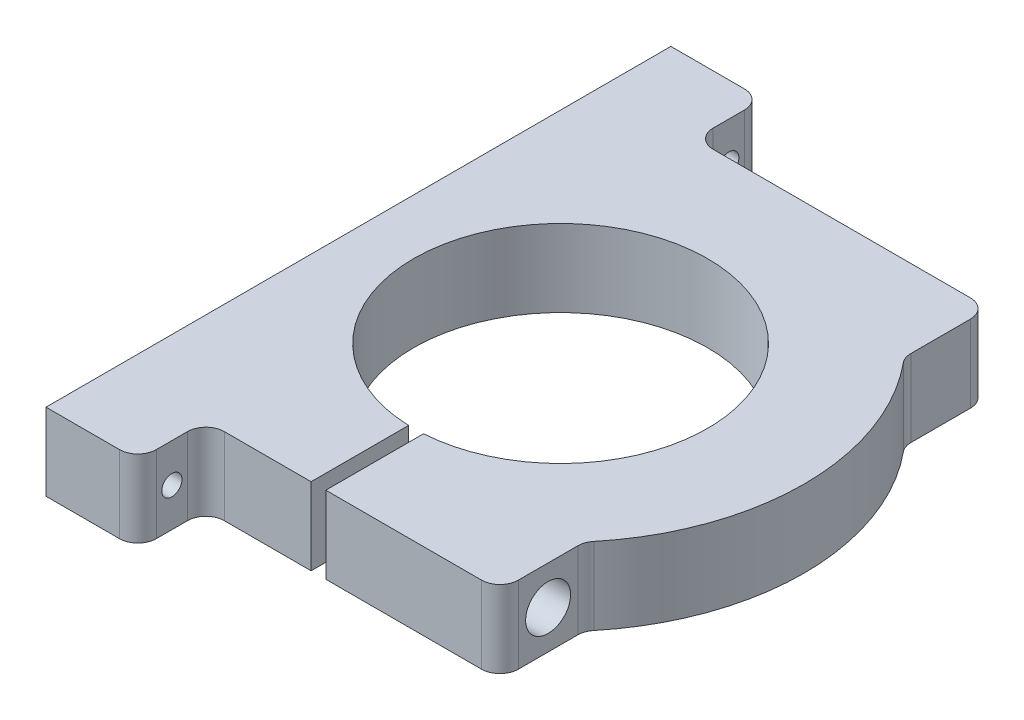
ISO-10303-21;
HEADER;
FILE_DESCRIPTION(('STEP AP214'),'2;1');
FILE_NAME('part.step','',(''),(''),'','','');
FILE_SCHEMA(('AUTOMOTIVE_DESIGN { 1 0 10303 214 1 1 1 1 }'));
ENDSEC;
DATA;
#1=APPLICATION_CONTEXT('core data for automotive mechanical design processes');
#2=APPLICATION_PROTOCOL_DEFINITION('international standard','automotive_design',2000,#1);
#3=PRODUCT_CONTEXT('',#1,'mechanical');
#4=PRODUCT('Part','Part','',(#3));
#5=PRODUCT_RELATED_PRODUCT_CATEGORY('part','',(#4));
#6=PRODUCT_DEFINITION_FORMATION('','',#4);
#7=PRODUCT_DEFINITION_CONTEXT('part definition',#1,'design');
#8=PRODUCT_DEFINITION('design','',#6,#7);
#9=PRODUCT_DEFINITION_SHAPE('','',#8);
#10=(LENGTH_UNIT() NAMED_UNIT(*) SI_UNIT(.MILLI.,.METRE.));
#11=(NAMED_UNIT(*) PLANE_ANGLE_UNIT() SI_UNIT($,.RADIAN.));
#12=(NAMED_UNIT(*) SI_UNIT($,.STERADIAN.) SOLID_ANGLE_UNIT());
#13=UNCERTAINTY_MEASURE_WITH_UNIT(LENGTH_MEASURE(1.E-05),#10,'distance_accuracy_value','');
#14=(GEOMETRIC_REPRESENTATION_CONTEXT(3) GLOBAL_UNCERTAINTY_ASSIGNED_CONTEXT((#13)) GLOBAL_UNIT_ASSIGNED_CONTEXT((#10,
#11,#12)) REPRESENTATION_CONTEXT('',''));
#15=CARTESIAN_POINT('',(0.,0.,0.));
#16=DIRECTION('',(0.,0.,1.));
#17=DIRECTION('',(1.,0.,0.));
#18=AXIS2_PLACEMENT_3D('',#15,#16,#17);
#19=CARTESIAN_POINT('',(-34.049591976291,-21.,0.));
#20=DIRECTION('',(-1.,0.,0.));
#21=DIRECTION('',(0.,0.,1.));
#22=AXIS2_PLACEMENT_3D('',#19,#20,#21);
#23=PLANE('',#22);
#24=CARTESIAN_POINT('',(-34.049591976291,-10.5,-263.540774929207));
#25=DIRECTION('',(1.,0.,0.));
#26=DIRECTION('',(0.,0.,-1.));
#27=AXIS2_PLACEMENT_3D('',#24,#25,#26);
#28=CIRCLE('',#27,2.1);
#29=CARTESIAN_POINT('',(-34.049591976291,-10.5,-265.640774929207));
#30=VERTEX_POINT('',#29);
#31=EDGE_CURVE('E509',#30,#30,#28,.T.);
#32=ORIENTED_EDGE('',*,*,#31,.F.);
#33=EDGE_LOOP('',(#32));
#34=FACE_BOUND('',#33,.T.);
#35=DIRECTION('',(0.,0.,1.));
#36=VECTOR('',#35,1.);
#37=CARTESIAN_POINT('',(-34.049591976291,0.,0.));
#38=LINE('',#37,#36);
#39=CARTESIAN_POINT('',(-34.049591976291,0.,-276.961503392199));
#40=VERTEX_POINT('',#39);
#41=CARTESIAN_POINT('',(-34.049591976291,0.,-250.437863594199));
#42=VERTEX_POINT('',#41);
#43=EDGE_CURVE('E240',#40,#42,#38,.T.);
#44=ORIENTED_EDGE('',*,*,#43,.T.);
#45=DIRECTION('',(0.,1.,0.));
#46=VECTOR('',#45,1.);
#47=CARTESIAN_POINT('',(-34.049591976291,-21.,-250.437863594199));
#48=LINE('',#47,#46);
#49=CARTESIAN_POINT('',(-34.049591976291,-21.,-250.437863594199));
#50=VERTEX_POINT('',#49);
#51=EDGE_CURVE('E201',#50,#42,#48,.T.);
#52=ORIENTED_EDGE('',*,*,#51,.F.);
#53=DIRECTION('',(0.,0.,1.));
#54=VECTOR('',#53,1.);
#55=CARTESIAN_POINT('',(-34.049591976291,-21.,0.));
#56=LINE('',#55,#54);
#57=CARTESIAN_POINT('',(-34.049591976291,-21.,-276.961503392199));
#58=VERTEX_POINT('',#57);
#59=EDGE_CURVE('E199',#58,#50,#56,.T.);
#60=ORIENTED_EDGE('',*,*,#59,.F.);
#61=DIRECTION('',(0.,1.,0.));
#62=VECTOR('',#61,1.);
#63=CARTESIAN_POINT('',(-34.049591976291,-21.,-276.961503392199));
#64=LINE('',#63,#62);
#65=EDGE_CURVE('E184',#58,#40,#64,.T.);
#66=ORIENTED_EDGE('',*,*,#65,.T.);
#67=EDGE_LOOP('',(#44,#52,#60,#66));
#68=FACE_BOUND('',#67,.T.);
#69=ADVANCED_FACE('F34',(#34,#68),#23,.F.);
#70=CARTESIAN_POINT('',(0.,-21.,-250.437863594199));
#71=DIRECTION('',(0.,0.,-1.));
#72=DIRECTION('',(-1.,0.,0.));
#73=AXIS2_PLACEMENT_3D('',#70,#71,#72);
#74=PLANE('',#73);
#75=DIRECTION('',(-1.,0.,0.));
#76=VECTOR('',#75,1.);
#77=CARTESIAN_POINT('',(0.,0.,-250.437863594199));
#78=LINE('',#77,#76);
#79=CARTESIAN_POINT('',(-57.674591976291,0.,-250.437863594199));
#80=VERTEX_POINT('',#79);
#81=EDGE_CURVE('E203',#42,#80,#78,.T.);
#82=ORIENTED_EDGE('',*,*,#81,.T.);
#83=DIRECTION('',(0.,1.,0.));
#84=VECTOR('',#83,1.);
#85=CARTESIAN_POINT('',(-57.674591976291,-21.,-250.437863594199));
#86=LINE('',#85,#84);
#87=CARTESIAN_POINT('',(-57.674591976291,-21.,-250.437863594199));
#88=VERTEX_POINT('',#87);
#89=EDGE_CURVE('E309',#80,#88,#86,.F.);
#90=ORIENTED_EDGE('',*,*,#89,.T.);
#91=DIRECTION('',(-1.,0.,0.));
#92=VECTOR('',#91,1.);
#93=CARTESIAN_POINT('',(0.,-21.,-250.437863594199));
#94=LINE('',#93,#92);
#95=EDGE_CURVE('E195',#50,#88,#94,.T.);
#96=ORIENTED_EDGE('',*,*,#95,.F.);
#97=ORIENTED_EDGE('',*,*,#51,.T.);
#98=EDGE_LOOP('',(#82,#90,#96,#97));
#99=FACE_BOUND('',#98,.T.);
#100=ADVANCED_FACE('F386',(#99),#74,.F.);
#101=CARTESIAN_POINT('',(-62.674591976291,-21.,0.));
#102=DIRECTION('',(-1.,0.,0.));
#103=DIRECTION('',(0.,0.,1.));
#104=AXIS2_PLACEMENT_3D('',#101,#102,#103);
#105=PLANE('',#104);
#106=CARTESIAN_POINT('',(-62.674591976291,-10.5,-241.187863594199));
#107=DIRECTION('',(-1.,0.,0.));
#108=DIRECTION('',(0.,0.,1.));
#109=AXIS2_PLACEMENT_3D('',#106,#107,#108);
#110=CIRCLE('',#109,2.74999999999998);
#111=CARTESIAN_POINT('',(-62.674591976291,-10.5,-238.437863594199));
#112=VERTEX_POINT('',#111);
#113=EDGE_CURVE('E520',#112,#112,#110,.T.);
#114=ORIENTED_EDGE('',*,*,#113,.T.);
#115=EDGE_LOOP('',(#114));
#116=FACE_BOUND('',#115,.T.);
#117=DIRECTION('',(0.,0.,1.));
#118=VECTOR('',#117,1.);
#119=CARTESIAN_POINT('',(-62.674591976291,0.,0.));
#120=LINE('',#119,#118);
#121=CARTESIAN_POINT('',(-62.674591976291,0.,-245.437863594199));
#122=VERTEX_POINT('',#121);
#123=CARTESIAN_POINT('',(-62.674591976291,0.,-236.937863594199));
#124=VERTEX_POINT('',#123);
#125=EDGE_CURVE('E270',#122,#124,#120,.T.);
#126=ORIENTED_EDGE('',*,*,#125,.T.);
#127=DIRECTION('',(0.,1.,0.));
#128=VECTOR('',#127,1.);
#129=CARTESIAN_POINT('',(-62.674591976291,-21.,-236.937863594199));
#130=LINE('',#129,#128);
#131=CARTESIAN_POINT('',(-62.674591976291,-21.,-236.937863594199));
#132=VERTEX_POINT('',#131);
#133=EDGE_CURVE('E300',#124,#132,#130,.F.);
#134=ORIENTED_EDGE('',*,*,#133,.T.);
#135=DIRECTION('',(0.,0.,1.));
#136=VECTOR('',#135,1.);
#137=CARTESIAN_POINT('',(-62.674591976291,-21.,0.));
#138=LINE('',#137,#136);
#139=CARTESIAN_POINT('',(-62.674591976291,-21.,-245.437863594199));
#140=VERTEX_POINT('',#139);
#141=EDGE_CURVE('E237',#140,#132,#138,.T.);
#142=ORIENTED_EDGE('',*,*,#141,.F.);
#143=DIRECTION('',(0.,1.,0.));
#144=VECTOR('',#143,1.);
#145=CARTESIAN_POINT('',(-62.674591976291,0.,-245.437863594199));
#146=LINE('',#145,#144);
#147=EDGE_CURVE('E297',#140,#122,#146,.T.);
#148=ORIENTED_EDGE('',*,*,#147,.T.);
#149=EDGE_LOOP('',(#126,#134,#142,#148));
#150=FACE_BOUND('',#149,.T.);
#151=ADVANCED_FACE('F392',(#116,#150),#105,.F.);
#152=CARTESIAN_POINT('',(0.,-21.,-231.937863594199));
#153=DIRECTION('',(0.,0.,-1.));
#154=DIRECTION('',(-1.,0.,0.));
#155=AXIS2_PLACEMENT_3D('',#152,#153,#154);
#156=PLANE('',#155);
#157=DIRECTION('',(-1.,0.,0.));
#158=VECTOR('',#157,1.);
#159=CARTESIAN_POINT('',(0.,-21.,-231.937863594199));
#160=LINE('',#159,#158);
#161=CARTESIAN_POINT('',(-67.674591976291,-21.,-231.937863594199));
#162=VERTEX_POINT('',#161);
#163=CARTESIAN_POINT('',(-87.674591976291,-21.,-231.937863594199));
#164=VERTEX_POINT('',#163);
#165=EDGE_CURVE('E235',#162,#164,#160,.T.);
#166=ORIENTED_EDGE('',*,*,#165,.F.);
#167=DIRECTION('',(0.,1.,0.));
#168=VECTOR('',#167,1.);
#169=CARTESIAN_POINT('',(-67.674591976291,-21.,-231.937863594199));
#170=LINE('',#169,#168);
#171=CARTESIAN_POINT('',(-67.674591976291,0.,-231.937863594199));
#172=VERTEX_POINT('',#171);
#173=EDGE_CURVE('E276',#162,#172,#170,.T.);
#174=ORIENTED_EDGE('',*,*,#173,.T.);
#175=DIRECTION('',(-1.,0.,0.));
#176=VECTOR('',#175,1.);
#177=CARTESIAN_POINT('',(0.,0.,-231.937863594199));
#178=LINE('',#177,#176);
#179=CARTESIAN_POINT('',(-87.674591976291,0.,-231.937863594199));
#180=VERTEX_POINT('',#179);
#181=EDGE_CURVE('E268',#172,#180,#178,.T.);
#182=ORIENTED_EDGE('',*,*,#181,.T.);
#183=DIRECTION('',(0.,1.,0.));
#184=VECTOR('',#183,1.);
#185=CARTESIAN_POINT('',(-87.674591976291,-21.,-231.937863594199));
#186=LINE('',#185,#184);
#187=EDGE_CURVE('E277',#164,#180,#186,.T.);
#188=ORIENTED_EDGE('',*,*,#187,.F.);
#189=EDGE_LOOP('',(#166,#174,#182,#188));
#190=FACE_BOUND('',#189,.T.);
#191=ADVANCED_FACE('F461',(#190),#156,.F.);
#192=CARTESIAN_POINT('',(-87.674591976291,-21.,0.));
#193=DIRECTION('',(1.,0.,0.));
#194=DIRECTION('',(0.,0.,-1.));
#195=AXIS2_PLACEMENT_3D('',#192,#193,#194);
#196=PLANE('',#195);
#197=CARTESIAN_POINT('',(-87.674591976291,-10.5,-263.540774929207));
#198=DIRECTION('',(1.,0.,0.));
#199=DIRECTION('',(0.,0.,-1.));
#200=AXIS2_PLACEMENT_3D('',#197,#198,#199);
#201=CIRCLE('',#200,2.09999999999999);
#202=CARTESIAN_POINT('',(-87.674591976291,-10.5,-265.640774929207));
#203=VERTEX_POINT('',#202);
#204=EDGE_CURVE('E503',#203,#203,#201,.T.);
#205=ORIENTED_EDGE('',*,*,#204,.T.);
#206=EDGE_LOOP('',(#205));
#207=FACE_BOUND('',#206,.T.);
#208=CARTESIAN_POINT('',(-87.674591976291,-10.5,-241.187863594199));
#209=DIRECTION('',(1.,0.,0.));
#210=DIRECTION('',(0.,0.,-1.));
#211=AXIS2_PLACEMENT_3D('',#208,#209,#210);
#212=CIRCLE('',#211,2.74999999999997);
#213=CARTESIAN_POINT('',(-87.674591976291,-10.5,-243.937863594199));
#214=VERTEX_POINT('',#213);
#215=EDGE_CURVE('E517',#214,#214,#212,.T.);
#216=ORIENTED_EDGE('',*,*,#215,.T.);
#217=EDGE_LOOP('',(#216));
#218=FACE_BOUND('',#217,.T.);
#219=CARTESIAN_POINT('',(-87.674591976291,-10.5,-392.687863594199));
#220=DIRECTION('',(1.,0.,0.));
#221=DIRECTION('',(0.,0.,-1.));
#222=AXIS2_PLACEMENT_3D('',#219,#220,#221);
#223=CIRCLE('',#222,2.74999999999997);
#224=CARTESIAN_POINT('',(-87.674591976291,-10.5,-395.437863594199));
#225=VERTEX_POINT('',#224);
#226=EDGE_CURVE('E522',#225,#225,#223,.T.);
#227=ORIENTED_EDGE('',*,*,#226,.T.);
#228=EDGE_LOOP('',(#227));
#229=FACE_BOUND('',#228,.T.);
#230=DIRECTION('',(0.,0.,-1.));
#231=VECTOR('',#230,1.);
#232=CARTESIAN_POINT('',(-87.674591976291,0.,0.));
#233=LINE('',#232,#231);
#234=CARTESIAN_POINT('',(-87.674591976291,0.,-401.937863594199));
#235=VERTEX_POINT('',#234);
#236=EDGE_CURVE('E266',#180,#235,#233,.T.);
#237=ORIENTED_EDGE('',*,*,#236,.T.);
#238=DIRECTION('',(0.,1.,0.));
#239=VECTOR('',#238,1.);
#240=CARTESIAN_POINT('',(-87.674591976291,-21.,-401.937863594199));
#241=LINE('',#240,#239);
#242=CARTESIAN_POINT('',(-87.674591976291,-21.,-401.937863594199));
#243=VERTEX_POINT('',#242);
#244=EDGE_CURVE('E280',#243,#235,#241,.T.);
#245=ORIENTED_EDGE('',*,*,#244,.F.);
#246=DIRECTION('',(0.,0.,-1.));
#247=VECTOR('',#246,1.);
#248=CARTESIAN_POINT('',(-87.674591976291,-21.,0.));
#249=LINE('',#248,#247);
#250=EDGE_CURVE('E233',#164,#243,#249,.T.);
#251=ORIENTED_EDGE('',*,*,#250,.F.);
#252=ORIENTED_EDGE('',*,*,#187,.T.);
#253=EDGE_LOOP('',(#237,#245,#251,#252));
#254=FACE_BOUND('',#253,.T.);
#255=ADVANCED_FACE('F456',(#207,#218,#229,#254),#196,.F.);
#256=CARTESIAN_POINT('',(0.,-21.,-401.937863594199));
#257=DIRECTION('',(0.,0.,1.));
#258=DIRECTION('',(1.,0.,0.));
#259=AXIS2_PLACEMENT_3D('',#256,#257,#258);
#260=PLANE('',#259);
#261=DIRECTION('',(1.,0.,0.));
#262=VECTOR('',#261,1.);
#263=CARTESIAN_POINT('',(0.,0.,-401.937863594199));
#264=LINE('',#263,#262);
#265=CARTESIAN_POINT('',(-67.674591976291,0.,-401.937863594199));
#266=VERTEX_POINT('',#265);
#267=EDGE_CURVE('E263',#235,#266,#264,.T.);
#268=ORIENTED_EDGE('',*,*,#267,.T.);
#269=DIRECTION('',(0.,1.,0.));
#270=VECTOR('',#269,1.);
#271=CARTESIAN_POINT('',(-67.674591976291,-21.,-401.937863594199));
#272=LINE('',#271,#270);
#273=CARTESIAN_POINT('',(-67.674591976291,-21.,-401.937863594199));
#274=VERTEX_POINT('',#273);
#275=EDGE_CURVE('E323',#266,#274,#272,.F.);
#276=ORIENTED_EDGE('',*,*,#275,.T.);
#277=DIRECTION('',(1.,0.,0.));
#278=VECTOR('',#277,1.);
#279=CARTESIAN_POINT('',(0.,-21.,-401.937863594199));
#280=LINE('',#279,#278);
#281=EDGE_CURVE('E230',#243,#274,#280,.T.);
#282=ORIENTED_EDGE('',*,*,#281,.F.);
#283=ORIENTED_EDGE('',*,*,#244,.T.);
#284=EDGE_LOOP('',(#268,#276,#282,#283));
#285=FACE_BOUND('',#284,.T.);
#286=ADVANCED_FACE('F451',(#285),#260,.F.);
#287=CARTESIAN_POINT('',(-62.674591976291,-21.,0.));
#288=DIRECTION('',(-1.,0.,0.));
#289=DIRECTION('',(0.,0.,1.));
#290=AXIS2_PLACEMENT_3D('',#287,#288,#289);
#291=PLANE('',#290);
#292=CARTESIAN_POINT('',(-62.674591976291,-10.5,-392.687863594199));
#293=DIRECTION('',(-1.,0.,0.));
#294=DIRECTION('',(0.,0.,1.));
#295=AXIS2_PLACEMENT_3D('',#292,#293,#294);
#296=CIRCLE('',#295,2.74999999999998);
#297=CARTESIAN_POINT('',(-62.674591976291,-10.5,-389.937863594199));
#298=VERTEX_POINT('',#297);
#299=EDGE_CURVE('E242',#298,#298,#296,.T.);
#300=ORIENTED_EDGE('',*,*,#299,.T.);
#301=EDGE_LOOP('',(#300));
#302=FACE_BOUND('',#301,.T.);
#303=DIRECTION('',(0.,0.,1.));
#304=VECTOR('',#303,1.);
#305=CARTESIAN_POINT('',(-62.674591976291,-21.,0.));
#306=LINE('',#305,#304);
#307=CARTESIAN_POINT('',(-62.674591976291,-21.,-396.937863594199));
#308=VERTEX_POINT('',#307);
#309=CARTESIAN_POINT('',(-62.674591976291,-21.,-388.437863594199));
#310=VERTEX_POINT('',#309);
#311=EDGE_CURVE('E227',#308,#310,#306,.T.);
#312=ORIENTED_EDGE('',*,*,#311,.F.);
#313=DIRECTION('',(0.,1.,0.));
#314=VECTOR('',#313,1.);
#315=CARTESIAN_POINT('',(-62.674591976291,-21.,-396.937863594199));
#316=LINE('',#315,#314);
#317=CARTESIAN_POINT('',(-62.674591976291,0.,-396.937863594199));
#318=VERTEX_POINT('',#317);
#319=EDGE_CURVE('E320',#308,#318,#316,.T.);
#320=ORIENTED_EDGE('',*,*,#319,.T.);
#321=DIRECTION('',(0.,0.,1.));
#322=VECTOR('',#321,1.);
#323=CARTESIAN_POINT('',(-62.674591976291,0.,0.));
#324=LINE('',#323,#322);
#325=CARTESIAN_POINT('',(-62.674591976291,0.,-388.437863594199));
#326=VERTEX_POINT('',#325);
#327=EDGE_CURVE('E260',#318,#326,#324,.T.);
#328=ORIENTED_EDGE('',*,*,#327,.T.);
#329=DIRECTION('',(0.,1.,0.));
#330=VECTOR('',#329,1.);
#331=CARTESIAN_POINT('',(-62.674591976291,-21.,-388.437863594199));
#332=LINE('',#331,#330);
#333=EDGE_CURVE('E318',#326,#310,#332,.F.);
#334=ORIENTED_EDGE('',*,*,#333,.T.);
#335=EDGE_LOOP('',(#312,#320,#328,#334));
#336=FACE_BOUND('',#335,.T.);
#337=ADVANCED_FACE('F444',(#302,#336),#291,.F.);
#338=CARTESIAN_POINT('',(0.,-21.,-383.437863594199));
#339=DIRECTION('',(0.,0.,1.));
#340=DIRECTION('',(1.,0.,0.));
#341=AXIS2_PLACEMENT_3D('',#338,#339,#340);
#342=PLANE('',#341);
#343=DIRECTION('',(1.,0.,0.));
#344=VECTOR('',#343,1.);
#345=CARTESIAN_POINT('',(0.,-21.,-383.437863594199));
#346=LINE('',#345,#344);
#347=CARTESIAN_POINT('',(-57.674591976291,-21.,-383.437863594199));
#348=VERTEX_POINT('',#347);
#349=CARTESIAN_POINT('',(12.325408023709,-21.,-383.437863594199));
#350=VERTEX_POINT('',#349);
#351=EDGE_CURVE('E224',#348,#350,#346,.T.);
#352=ORIENTED_EDGE('',*,*,#351,.F.);
#353=DIRECTION('',(0.,1.,0.));
#354=VECTOR('',#353,1.);
#355=CARTESIAN_POINT('',(-57.674591976291,0.,-383.437863594199));
#356=LINE('',#355,#354);
#357=CARTESIAN_POINT('',(-57.674591976291,0.,-383.437863594199));
#358=VERTEX_POINT('',#357);
#359=EDGE_CURVE('E327',#348,#358,#356,.T.);
#360=ORIENTED_EDGE('',*,*,#359,.T.);
#361=DIRECTION('',(1.,0.,0.));
#362=VECTOR('',#361,1.);
#363=CARTESIAN_POINT('',(0.,0.,-383.437863594199));
#364=LINE('',#363,#362);
#365=CARTESIAN_POINT('',(12.325408023709,0.,-383.437863594199));
#366=VERTEX_POINT('',#365);
#367=EDGE_CURVE('E257',#358,#366,#364,.T.);
#368=ORIENTED_EDGE('',*,*,#367,.T.);
#369=DIRECTION('',(0.,1.,0.));
#370=VECTOR('',#369,1.);
#371=CARTESIAN_POINT('',(12.325408023709,-21.,-383.437863594199));
#372=LINE('',#371,#370);
#373=EDGE_CURVE('E325',#366,#350,#372,.F.);
#374=ORIENTED_EDGE('',*,*,#373,.T.);
#375=EDGE_LOOP('',(#352,#360,#368,#374));
#376=FACE_BOUND('',#375,.T.);
#377=ADVANCED_FACE('F437',(#376),#342,.F.);
#378=CARTESIAN_POINT('',(17.325408023709,-21.,0.));
#379=DIRECTION('',(-1.,0.,0.));
#380=DIRECTION('',(0.,0.,1.));
#381=AXIS2_PLACEMENT_3D('',#378,#379,#380);
#382=PLANE('',#381);
#383=DIRECTION('',(0.,0.,1.));
#384=VECTOR('',#383,1.);
#385=CARTESIAN_POINT('',(17.325408023709,-21.,0.));
#386=LINE('',#385,#384);
#387=CARTESIAN_POINT('',(17.325408023709,-21.,-378.437863594199));
#388=VERTEX_POINT('',#387);
#389=CARTESIAN_POINT('',(17.325408023709,-21.,-362.232040924182));
#390=VERTEX_POINT('',#389);
#391=EDGE_CURVE('E221',#388,#390,#386,.T.);
#392=ORIENTED_EDGE('',*,*,#391,.F.);
#393=DIRECTION('',(0.,1.,0.));
#394=VECTOR('',#393,1.);
#395=CARTESIAN_POINT('',(17.325408023709,-21.,-378.437863594199));
#396=LINE('',#395,#394);
#397=CARTESIAN_POINT('',(17.325408023709,0.,-378.437863594199));
#398=VERTEX_POINT('',#397);
#399=EDGE_CURVE('E332',#388,#398,#396,.T.);
#400=ORIENTED_EDGE('',*,*,#399,.T.);
#401=DIRECTION('',(0.,0.,1.));
#402=VECTOR('',#401,1.);
#403=CARTESIAN_POINT('',(17.325408023709,0.,0.));
#404=LINE('',#403,#402);
#405=CARTESIAN_POINT('',(17.325408023709,0.,-362.232040924182));
#406=VERTEX_POINT('',#405);
#407=EDGE_CURVE('E254',#398,#406,#404,.T.);
#408=ORIENTED_EDGE('',*,*,#407,.T.);
#409=DIRECTION('',(0.,-1.,0.));
#410=VECTOR('',#409,1.);
#411=CARTESIAN_POINT('',(17.325408023709,-21.,-362.232040924182));
#412=LINE('',#411,#410);
#413=EDGE_CURVE('E330',#406,#390,#412,.T.);
#414=ORIENTED_EDGE('',*,*,#413,.T.);
#415=EDGE_LOOP('',(#392,#400,#408,#414));
#416=FACE_BOUND('',#415,.T.);
#417=ADVANCED_FACE('F431',(#416),#382,.F.);
#418=CARTESIAN_POINT('',(-32.674591976291,-21.,-316.937863594199));
#419=DIRECTION('',(0.,1.,0.));
#420=DIRECTION('',(0.,0.,1.));
#421=AXIS2_PLACEMENT_3D('',#418,#419,#420);
#422=CYLINDRICAL_SURFACE('',#421,66.25);
#423=CARTESIAN_POINT('',(-32.674591976291,-21.,-316.937863594199));
#424=DIRECTION('',(0.,1.,0.));
#425=DIRECTION('',(0.,0.,1.));
#426=AXIS2_PLACEMENT_3D('',#423,#424,#425);
#427=CIRCLE('',#426,66.25);
#428=CARTESIAN_POINT('',(18.465758900902,-21.,-359.053502164183));
#429=VERTEX_POINT('',#428);
#430=CARTESIAN_POINT('',(18.465758900902,-21.,-274.822225024214));
#431=VERTEX_POINT('',#430);
#432=EDGE_CURVE('E218',#429,#431,#427,.F.);
#433=ORIENTED_EDGE('',*,*,#432,.F.);
#434=DIRECTION('',(0.,1.,0.));
#435=VECTOR('',#434,1.);
#436=CARTESIAN_POINT('',(18.465758900902,-21.,-359.053502164183));
#437=LINE('',#436,#435);
#438=CARTESIAN_POINT('',(18.465758900902,0.,-359.053502164183));
#439=VERTEX_POINT('',#438);
#440=EDGE_CURVE('E337',#429,#439,#437,.T.);
#441=ORIENTED_EDGE('',*,*,#440,.T.);
#442=CARTESIAN_POINT('',(-32.674591976291,0.,-316.937863594199));
#443=DIRECTION('',(0.,1.,0.));
#444=DIRECTION('',(0.,0.,1.));
#445=AXIS2_PLACEMENT_3D('',#442,#443,#444);
#446=CIRCLE('',#445,66.25);
#447=CARTESIAN_POINT('',(18.465758900902,0.,-274.822225024214));
#448=VERTEX_POINT('',#447);
#449=EDGE_CURVE('E251',#439,#448,#446,.F.);
#450=ORIENTED_EDGE('',*,*,#449,.T.);
#451=DIRECTION('',(0.,1.,0.));
#452=VECTOR('',#451,1.);
#453=CARTESIAN_POINT('',(18.465758900902,-21.,-274.822225024214));
#454=LINE('',#453,#452);
#455=EDGE_CURVE('E335',#448,#431,#454,.F.);
#456=ORIENTED_EDGE('',*,*,#455,.T.);
#457=EDGE_LOOP('',(#433,#441,#450,#456));
#458=FACE_BOUND('',#457,.T.);
#459=ADVANCED_FACE('F361',(#458),#422,.T.);
#460=CARTESIAN_POINT('',(17.325408023709,-21.,0.));
#461=DIRECTION('',(-1.,0.,0.));
#462=DIRECTION('',(0.,0.,1.));
#463=AXIS2_PLACEMENT_3D('',#460,#461,#462);
#464=PLANE('',#463);
#465=CARTESIAN_POINT('',(17.325408023709,-10.5,-263.540774929207));
#466=DIRECTION('',(1.,0.,0.));
#467=DIRECTION('',(0.,0.,-1.));
#468=AXIS2_PLACEMENT_3D('',#465,#466,#467);
#469=CIRCLE('',#468,6.119);
#470=CARTESIAN_POINT('',(17.325408023709,-10.5,-269.659774929207));
#471=VERTEX_POINT('',#470);
#472=EDGE_CURVE('E500',#471,#471,#469,.T.);
#473=ORIENTED_EDGE('',*,*,#472,.F.);
#474=EDGE_LOOP('',(#473));
#475=FACE_BOUND('',#474,.T.);
#476=DIRECTION('',(0.,0.,1.));
#477=VECTOR('',#476,1.);
#478=CARTESIAN_POINT('',(17.325408023709,0.,0.));
#479=LINE('',#478,#477);
#480=CARTESIAN_POINT('',(17.325408023709,0.,-271.643686264215));
#481=VERTEX_POINT('',#480);
#482=CARTESIAN_POINT('',(17.325408023709,0.,-255.437863594199));
#483=VERTEX_POINT('',#482);
#484=EDGE_CURVE('E249',#481,#483,#479,.T.);
#485=ORIENTED_EDGE('',*,*,#484,.T.);
#486=DIRECTION('',(0.,1.,0.));
#487=VECTOR('',#486,1.);
#488=CARTESIAN_POINT('',(17.325408023709,-21.,-255.437863594199));
#489=LINE('',#488,#487);
#490=CARTESIAN_POINT('',(17.325408023709,-21.,-255.437863594199));
#491=VERTEX_POINT('',#490);
#492=EDGE_CURVE('E57',#483,#491,#489,.F.);
#493=ORIENTED_EDGE('',*,*,#492,.T.);
#494=DIRECTION('',(0.,0.,1.));
#495=VECTOR('',#494,1.);
#496=CARTESIAN_POINT('',(17.325408023709,-21.,0.));
#497=LINE('',#496,#495);
#498=CARTESIAN_POINT('',(17.325408023709,-21.,-271.643686264215));
#499=VERTEX_POINT('',#498);
#500=EDGE_CURVE('E216',#499,#491,#497,.T.);
#501=ORIENTED_EDGE('',*,*,#500,.F.);
#502=DIRECTION('',(0.,-1.,0.));
#503=VECTOR('',#502,1.);
#504=CARTESIAN_POINT('',(17.325408023709,0.,-271.643686264215));
#505=LINE('',#504,#503);
#506=EDGE_CURVE('E314',#499,#481,#505,.F.);
#507=ORIENTED_EDGE('',*,*,#506,.T.);
#508=EDGE_LOOP('',(#485,#493,#501,#507));
#509=FACE_BOUND('',#508,.T.);
#510=ADVANCED_FACE('F364',(#475,#509),#464,.F.);
#511=CARTESIAN_POINT('',(0.,-21.,-250.437863594199));
#512=DIRECTION('',(0.,0.,-1.));
#513=DIRECTION('',(-1.,0.,0.));
#514=AXIS2_PLACEMENT_3D('',#511,#512,#513);
#515=PLANE('',#514);
#516=DIRECTION('',(-1.,0.,0.));
#517=VECTOR('',#516,1.);
#518=CARTESIAN_POINT('',(0.,-21.,-250.437863594199));
#519=LINE('',#518,#517);
#520=CARTESIAN_POINT('',(12.325408023709,-21.,-250.437863594199));
#521=VERTEX_POINT('',#520);
#522=CARTESIAN_POINT('',(-30.049591976291,-21.,-250.437863594199));
#523=VERTEX_POINT('',#522);
#524=EDGE_CURVE('E211',#521,#523,#519,.T.);
#525=ORIENTED_EDGE('',*,*,#524,.F.);
#526=DIRECTION('',(0.,1.,0.));
#527=VECTOR('',#526,1.);
#528=CARTESIAN_POINT('',(12.325408023709,-21.,-250.437863594199));
#529=LINE('',#528,#527);
#530=CARTESIAN_POINT('',(12.325408023709,0.,-250.437863594199));
#531=VERTEX_POINT('',#530);
#532=EDGE_CURVE('E311',#521,#531,#529,.T.);
#533=ORIENTED_EDGE('',*,*,#532,.T.);
#534=DIRECTION('',(-1.,0.,0.));
#535=VECTOR('',#534,1.);
#536=CARTESIAN_POINT('',(0.,0.,-250.437863594199));
#537=LINE('',#536,#535);
#538=CARTESIAN_POINT('',(-30.049591976291,0.,-250.437863594199));
#539=VERTEX_POINT('',#538);
#540=EDGE_CURVE('E247',#531,#539,#537,.T.);
#541=ORIENTED_EDGE('',*,*,#540,.T.);
#542=DIRECTION('',(0.,1.,0.));
#543=VECTOR('',#542,1.);
#544=CARTESIAN_POINT('',(-30.049591976291,-21.,-250.437863594199));
#545=LINE('',#544,#543);
#546=EDGE_CURVE('E283',#523,#539,#545,.T.);
#547=ORIENTED_EDGE('',*,*,#546,.F.);
#548=EDGE_LOOP('',(#525,#533,#541,#547));
#549=FACE_BOUND('',#548,.T.);
#550=ADVANCED_FACE('F370',(#549),#515,.F.);
#551=CARTESIAN_POINT('',(-30.049591976291,-21.,0.));
#552=DIRECTION('',(1.,0.,0.));
#553=DIRECTION('',(0.,0.,-1.));
#554=AXIS2_PLACEMENT_3D('',#551,#552,#553);
#555=PLANE('',#554);
#556=CARTESIAN_POINT('',(-30.049591976291,-10.5,-263.540774929207));
#557=DIRECTION('',(1.,0.,0.));
#558=DIRECTION('',(0.,0.,-1.));
#559=AXIS2_PLACEMENT_3D('',#556,#557,#558);
#560=CIRCLE('',#559,2.74999999999999);
#561=CARTESIAN_POINT('',(-30.049591976291,-10.5,-266.290774929207));
#562=VERTEX_POINT('',#561);
#563=EDGE_CURVE('E515',#562,#562,#560,.T.);
#564=ORIENTED_EDGE('',*,*,#563,.T.);
#565=EDGE_LOOP('',(#564));
#566=FACE_BOUND('',#565,.T.);
#567=DIRECTION('',(0.,0.,-1.));
#568=VECTOR('',#567,1.);
#569=CARTESIAN_POINT('',(-30.049591976291,0.,0.));
#570=LINE('',#569,#568);
#571=CARTESIAN_POINT('',(-30.049591976291,0.,-277.024089342695));
#572=VERTEX_POINT('',#571);
#573=EDGE_CURVE('E244',#539,#572,#570,.T.);
#574=ORIENTED_EDGE('',*,*,#573,.T.);
#575=DIRECTION('',(0.,1.,0.));
#576=VECTOR('',#575,1.);
#577=CARTESIAN_POINT('',(-30.049591976291,-21.,-277.024089342695));
#578=LINE('',#577,#576);
#579=CARTESIAN_POINT('',(-30.049591976291,-21.,-277.024089342695));
#580=VERTEX_POINT('',#579);
#581=EDGE_CURVE('E194',#580,#572,#578,.T.);
#582=ORIENTED_EDGE('',*,*,#581,.F.);
#583=DIRECTION('',(0.,0.,-1.));
#584=VECTOR('',#583,1.);
#585=CARTESIAN_POINT('',(-30.049591976291,-21.,0.));
#586=LINE('',#585,#584);
#587=EDGE_CURVE('E208',#523,#580,#586,.T.);
#588=ORIENTED_EDGE('',*,*,#587,.F.);
#589=ORIENTED_EDGE('',*,*,#546,.T.);
#590=EDGE_LOOP('',(#574,#582,#588,#589));
#591=FACE_BOUND('',#590,.T.);
#592=ADVANCED_FACE('F374',(#566,#591),#555,.F.);
#593=CARTESIAN_POINT('',(-32.674591976291,-21.,-316.937863594199));
#594=DIRECTION('',(0.,1.,0.));
#595=DIRECTION('',(0.,0.,1.));
#596=AXIS2_PLACEMENT_3D('',#593,#594,#595);
#597=CYLINDRICAL_SURFACE('',#596,40.);
#598=CARTESIAN_POINT('',(-32.674591976291,0.,-316.937863594199));
#599=DIRECTION('',(0.,1.,0.));
#600=DIRECTION('',(0.,0.,1.));
#601=AXIS2_PLACEMENT_3D('',#598,#599,#600);
#602=CIRCLE('',#601,40.);
#603=EDGE_CURVE('E190',#40,#572,#602,.F.);
#604=ORIENTED_EDGE('',*,*,#603,.F.);
#605=ORIENTED_EDGE('',*,*,#65,.F.);
#606=CARTESIAN_POINT('',(-32.674591976291,-21.,-316.937863594199));
#607=DIRECTION('',(0.,1.,0.));
#608=DIRECTION('',(0.,0.,1.));
#609=AXIS2_PLACEMENT_3D('',#606,#607,#608);
#610=CIRCLE('',#609,40.);
#611=EDGE_CURVE('E188',#58,#580,#610,.F.);
#612=ORIENTED_EDGE('',*,*,#611,.T.);
#613=ORIENTED_EDGE('',*,*,#581,.T.);
#614=EDGE_LOOP('',(#604,#605,#612,#613));
#615=FACE_BOUND('',#614,.T.);
#616=ADVANCED_FACE('F186',(#615),#597,.F.);
#617=CARTESIAN_POINT('',(0.,-21.,0.));
#618=DIRECTION('',(0.,1.,0.));
#619=DIRECTION('',(0.,0.,1.));
#620=AXIS2_PLACEMENT_3D('',#617,#618,#619);
#621=PLANE('',#620);
#622=ORIENTED_EDGE('',*,*,#141,.T.);
#623=CARTESIAN_POINT('',(-67.674591976291,-21.,-236.937863594199));
#624=DIRECTION('',(0.,1.,0.));
#625=DIRECTION('',(0.,0.,1.));
#626=AXIS2_PLACEMENT_3D('',#623,#624,#625);
#627=CIRCLE('',#626,5.);
#628=EDGE_CURVE('E307',#132,#162,#627,.F.);
#629=ORIENTED_EDGE('',*,*,#628,.T.);
#630=ORIENTED_EDGE('',*,*,#165,.T.);
#631=ORIENTED_EDGE('',*,*,#250,.T.);
#632=ORIENTED_EDGE('',*,*,#281,.T.);
#633=CARTESIAN_POINT('',(-67.674591976291,-21.,-396.937863594199));
#634=DIRECTION('',(0.,1.,0.));
#635=DIRECTION('',(0.,0.,1.));
#636=AXIS2_PLACEMENT_3D('',#633,#634,#635);
#637=CIRCLE('',#636,5.);
#638=EDGE_CURVE('E304',#274,#308,#637,.F.);
#639=ORIENTED_EDGE('',*,*,#638,.T.);
#640=ORIENTED_EDGE('',*,*,#311,.T.);
#641=CARTESIAN_POINT('',(-57.674591976291,-21.,-388.437863594199));
#642=DIRECTION('',(0.,1.,0.));
#643=DIRECTION('',(0.,0.,1.));
#644=AXIS2_PLACEMENT_3D('',#641,#642,#643);
#645=CIRCLE('',#644,5.);
#646=EDGE_CURVE('E346',#310,#348,#645,.T.);
#647=ORIENTED_EDGE('',*,*,#646,.T.);
#648=ORIENTED_EDGE('',*,*,#351,.T.);
#649=CARTESIAN_POINT('',(12.325408023709,-21.,-378.437863594199));
#650=DIRECTION('',(0.,1.,0.));
#651=DIRECTION('',(0.,0.,1.));
#652=AXIS2_PLACEMENT_3D('',#649,#650,#651);
#653=CIRCLE('',#652,5.);
#654=EDGE_CURVE('E302',#350,#388,#653,.F.);
#655=ORIENTED_EDGE('',*,*,#654,.T.);
#656=ORIENTED_EDGE('',*,*,#391,.T.);
#657=CARTESIAN_POINT('',(22.325408023709,-21.,-362.232040924182));
#658=DIRECTION('',(0.,1.,0.));
#659=DIRECTION('',(0.,0.,1.));
#660=AXIS2_PLACEMENT_3D('',#657,#658,#659);
#661=CIRCLE('',#660,5.);
#662=EDGE_CURVE('E350',#390,#429,#661,.T.);
#663=ORIENTED_EDGE('',*,*,#662,.T.);
#664=ORIENTED_EDGE('',*,*,#432,.T.);
#665=CARTESIAN_POINT('',(22.325408023709,-21.,-271.643686264215));
#666=DIRECTION('',(0.,1.,0.));
#667=DIRECTION('',(0.,0.,1.));
#668=AXIS2_PLACEMENT_3D('',#665,#666,#667);
#669=CIRCLE('',#668,5.);
#670=EDGE_CURVE('E11',#431,#499,#669,.T.);
#671=ORIENTED_EDGE('',*,*,#670,.T.);
#672=ORIENTED_EDGE('',*,*,#500,.T.);
#673=CARTESIAN_POINT('',(12.325408023709,-21.,-255.437863594199));
#674=DIRECTION('',(0.,1.,0.));
#675=DIRECTION('',(0.,0.,1.));
#676=AXIS2_PLACEMENT_3D('',#673,#674,#675);
#677=CIRCLE('',#676,5.);
#678=EDGE_CURVE('E49',#491,#521,#677,.F.);
#679=ORIENTED_EDGE('',*,*,#678,.T.);
#680=ORIENTED_EDGE('',*,*,#524,.T.);
#681=ORIENTED_EDGE('',*,*,#587,.T.);
#682=ORIENTED_EDGE('',*,*,#611,.F.);
#683=ORIENTED_EDGE('',*,*,#59,.T.);
#684=ORIENTED_EDGE('',*,*,#95,.T.);
#685=CARTESIAN_POINT('',(-57.674591976291,-21.,-245.437863594199));
#686=DIRECTION('',(0.,1.,0.));
#687=DIRECTION('',(0.,0.,1.));
#688=AXIS2_PLACEMENT_3D('',#685,#686,#687);
#689=CIRCLE('',#688,5.);
#690=EDGE_CURVE('E342',#88,#140,#689,.T.);
#691=ORIENTED_EDGE('',*,*,#690,.T.);
#692=EDGE_LOOP('',(#622,#629,#630,#631,#632,#639,#640,#647,#648,#655,#656,#663,#664,#671,#672,
#679,#680,#681,#682,#683,#684,#691));
#693=FACE_BOUND('',#692,.T.);
#694=ADVANCED_FACE('F206',(#693),#621,.F.);
#695=CARTESIAN_POINT('',(0.,0.,0.));
#696=DIRECTION('',(0.,1.,0.));
#697=DIRECTION('',(0.,0.,1.));
#698=AXIS2_PLACEMENT_3D('',#695,#696,#697);
#699=PLANE('',#698);
#700=ORIENTED_EDGE('',*,*,#181,.F.);
#701=CARTESIAN_POINT('',(-67.674591976291,0.,-236.937863594199));
#702=DIRECTION('',(0.,1.,0.));
#703=DIRECTION('',(0.,0.,1.));
#704=AXIS2_PLACEMENT_3D('',#701,#702,#703);
#705=CIRCLE('',#704,5.);
#706=EDGE_CURVE('E295',#172,#124,#705,.T.);
#707=ORIENTED_EDGE('',*,*,#706,.T.);
#708=ORIENTED_EDGE('',*,*,#125,.F.);
#709=CARTESIAN_POINT('',(-57.674591976291,0.,-245.437863594199));
#710=DIRECTION('',(0.,1.,0.));
#711=DIRECTION('',(0.,0.,1.));
#712=AXIS2_PLACEMENT_3D('',#709,#710,#711);
#713=CIRCLE('',#712,5.);
#714=EDGE_CURVE('E340',#122,#80,#713,.F.);
#715=ORIENTED_EDGE('',*,*,#714,.T.);
#716=ORIENTED_EDGE('',*,*,#81,.F.);
#717=ORIENTED_EDGE('',*,*,#43,.F.);
#718=ORIENTED_EDGE('',*,*,#603,.T.);
#719=ORIENTED_EDGE('',*,*,#573,.F.);
#720=ORIENTED_EDGE('',*,*,#540,.F.);
#721=CARTESIAN_POINT('',(12.325408023709,0.,-255.437863594199));
#722=DIRECTION('',(0.,1.,0.));
#723=DIRECTION('',(0.,0.,1.));
#724=AXIS2_PLACEMENT_3D('',#721,#722,#723);
#725=CIRCLE('',#724,5.);
#726=EDGE_CURVE('E293',#531,#483,#725,.T.);
#727=ORIENTED_EDGE('',*,*,#726,.T.);
#728=ORIENTED_EDGE('',*,*,#484,.F.);
#729=CARTESIAN_POINT('',(22.325408023709,0.,-271.643686264215));
#730=DIRECTION('',(0.,1.,0.));
#731=DIRECTION('',(0.,0.,1.));
#732=AXIS2_PLACEMENT_3D('',#729,#730,#731);
#733=CIRCLE('',#732,5.);
#734=EDGE_CURVE('E42',#481,#448,#733,.F.);
#735=ORIENTED_EDGE('',*,*,#734,.T.);
#736=ORIENTED_EDGE('',*,*,#449,.F.);
#737=CARTESIAN_POINT('',(22.325408023709,0.,-362.232040924182));
#738=DIRECTION('',(0.,1.,0.));
#739=DIRECTION('',(0.,0.,1.));
#740=AXIS2_PLACEMENT_3D('',#737,#738,#739);
#741=CIRCLE('',#740,5.);
#742=EDGE_CURVE('E348',#439,#406,#741,.F.);
#743=ORIENTED_EDGE('',*,*,#742,.T.);
#744=ORIENTED_EDGE('',*,*,#407,.F.);
#745=CARTESIAN_POINT('',(12.325408023709,0.,-378.437863594199));
#746=DIRECTION('',(0.,1.,0.));
#747=DIRECTION('',(0.,0.,1.));
#748=AXIS2_PLACEMENT_3D('',#745,#746,#747);
#749=CIRCLE('',#748,5.);
#750=EDGE_CURVE('E289',#398,#366,#749,.T.);
#751=ORIENTED_EDGE('',*,*,#750,.T.);
#752=ORIENTED_EDGE('',*,*,#367,.F.);
#753=CARTESIAN_POINT('',(-57.674591976291,0.,-388.437863594199));
#754=DIRECTION('',(0.,1.,0.));
#755=DIRECTION('',(0.,0.,1.));
#756=AXIS2_PLACEMENT_3D('',#753,#754,#755);
#757=CIRCLE('',#756,5.);
#758=EDGE_CURVE('E344',#358,#326,#757,.F.);
#759=ORIENTED_EDGE('',*,*,#758,.T.);
#760=ORIENTED_EDGE('',*,*,#327,.F.);
#761=CARTESIAN_POINT('',(-67.674591976291,0.,-396.937863594199));
#762=DIRECTION('',(0.,1.,0.));
#763=DIRECTION('',(0.,0.,1.));
#764=AXIS2_PLACEMENT_3D('',#761,#762,#763);
#765=CIRCLE('',#764,5.);
#766=EDGE_CURVE('E291',#318,#266,#765,.T.);
#767=ORIENTED_EDGE('',*,*,#766,.T.);
#768=ORIENTED_EDGE('',*,*,#267,.F.);
#769=ORIENTED_EDGE('',*,*,#236,.F.);
#770=EDGE_LOOP('',(#700,#707,#708,#715,#716,#717,#718,#719,#720,#727,#728,#735,#736,#743,#744,
#751,#752,#759,#760,#767,#768,#769));
#771=FACE_BOUND('',#770,.T.);
#772=ADVANCED_FACE('F355',(#771),#699,.T.);
#773=CARTESIAN_POINT('',(-67.674591976291,-21.,-236.937863594199));
#774=DIRECTION('',(0.,1.,0.));
#775=DIRECTION('',(0.,0.,1.));
#776=AXIS2_PLACEMENT_3D('',#773,#774,#775);
#777=CYLINDRICAL_SURFACE('',#776,5.);
#778=ORIENTED_EDGE('',*,*,#628,.F.);
#779=ORIENTED_EDGE('',*,*,#133,.F.);
#780=ORIENTED_EDGE('',*,*,#706,.F.);
#781=ORIENTED_EDGE('',*,*,#173,.F.);
#782=EDGE_LOOP('',(#778,#779,#780,#781));
#783=FACE_BOUND('',#782,.T.);
#784=ADVANCED_FACE('F397',(#783),#777,.T.);
#785=CARTESIAN_POINT('',(-57.674591976291,-21.,-245.437863594199));
#786=DIRECTION('',(0.,-1.,0.));
#787=DIRECTION('',(0.,0.,-1.));
#788=AXIS2_PLACEMENT_3D('',#785,#786,#787);
#789=CYLINDRICAL_SURFACE('',#788,5.);
#790=ORIENTED_EDGE('',*,*,#690,.F.);
#791=ORIENTED_EDGE('',*,*,#89,.F.);
#792=ORIENTED_EDGE('',*,*,#714,.F.);
#793=ORIENTED_EDGE('',*,*,#147,.F.);
#794=EDGE_LOOP('',(#790,#791,#792,#793));
#795=FACE_BOUND('',#794,.T.);
#796=ADVANCED_FACE('F400',(#795),#789,.F.);
#797=CARTESIAN_POINT('',(12.325408023709,-21.,-255.437863594199));
#798=DIRECTION('',(0.,1.,0.));
#799=DIRECTION('',(0.,0.,1.));
#800=AXIS2_PLACEMENT_3D('',#797,#798,#799);
#801=CYLINDRICAL_SURFACE('',#800,5.);
#802=ORIENTED_EDGE('',*,*,#678,.F.);
#803=ORIENTED_EDGE('',*,*,#492,.F.);
#804=ORIENTED_EDGE('',*,*,#726,.F.);
#805=ORIENTED_EDGE('',*,*,#532,.F.);
#806=EDGE_LOOP('',(#802,#803,#804,#805));
#807=FACE_BOUND('',#806,.T.);
#808=ADVANCED_FACE('F366',(#807),#801,.T.);
#809=CARTESIAN_POINT('',(-67.674591976291,-21.,-396.937863594199));
#810=DIRECTION('',(0.,1.,0.));
#811=DIRECTION('',(0.,0.,1.));
#812=AXIS2_PLACEMENT_3D('',#809,#810,#811);
#813=CYLINDRICAL_SURFACE('',#812,5.);
#814=ORIENTED_EDGE('',*,*,#638,.F.);
#815=ORIENTED_EDGE('',*,*,#275,.F.);
#816=ORIENTED_EDGE('',*,*,#766,.F.);
#817=ORIENTED_EDGE('',*,*,#319,.F.);
#818=EDGE_LOOP('',(#814,#815,#816,#817));
#819=FACE_BOUND('',#818,.T.);
#820=ADVANCED_FACE('F407',(#819),#813,.T.);
#821=CARTESIAN_POINT('',(-57.674591976291,-21.,-388.437863594199));
#822=DIRECTION('',(0.,-1.,0.));
#823=DIRECTION('',(0.,0.,-1.));
#824=AXIS2_PLACEMENT_3D('',#821,#822,#823);
#825=CYLINDRICAL_SURFACE('',#824,5.);
#826=ORIENTED_EDGE('',*,*,#646,.F.);
#827=ORIENTED_EDGE('',*,*,#333,.F.);
#828=ORIENTED_EDGE('',*,*,#758,.F.);
#829=ORIENTED_EDGE('',*,*,#359,.F.);
#830=EDGE_LOOP('',(#826,#827,#828,#829));
#831=FACE_BOUND('',#830,.T.);
#832=ADVANCED_FACE('F410',(#831),#825,.F.);
#833=CARTESIAN_POINT('',(12.325408023709,-21.,-378.437863594199));
#834=DIRECTION('',(0.,1.,0.));
#835=DIRECTION('',(0.,0.,1.));
#836=AXIS2_PLACEMENT_3D('',#833,#834,#835);
#837=CYLINDRICAL_SURFACE('',#836,5.);
#838=ORIENTED_EDGE('',*,*,#654,.F.);
#839=ORIENTED_EDGE('',*,*,#373,.F.);
#840=ORIENTED_EDGE('',*,*,#750,.F.);
#841=ORIENTED_EDGE('',*,*,#399,.F.);
#842=EDGE_LOOP('',(#838,#839,#840,#841));
#843=FACE_BOUND('',#842,.T.);
#844=ADVANCED_FACE('F414',(#843),#837,.T.);
#845=CARTESIAN_POINT('',(22.325408023709,-21.,-362.232040924182));
#846=DIRECTION('',(0.,1.,0.));
#847=DIRECTION('',(0.,0.,1.));
#848=AXIS2_PLACEMENT_3D('',#845,#846,#847);
#849=CYLINDRICAL_SURFACE('',#848,5.);
#850=ORIENTED_EDGE('',*,*,#662,.F.);
#851=ORIENTED_EDGE('',*,*,#413,.F.);
#852=ORIENTED_EDGE('',*,*,#742,.F.);
#853=ORIENTED_EDGE('',*,*,#440,.F.);
#854=EDGE_LOOP('',(#850,#851,#852,#853));
#855=FACE_BOUND('',#854,.T.);
#856=ADVANCED_FACE('F417',(#855),#849,.F.);
#857=CARTESIAN_POINT('',(22.325408023709,-21.,-271.643686264215));
#858=DIRECTION('',(0.,1.,0.));
#859=DIRECTION('',(0.,0.,1.));
#860=AXIS2_PLACEMENT_3D('',#857,#858,#859);
#861=CYLINDRICAL_SURFACE('',#860,5.);
#862=ORIENTED_EDGE('',*,*,#670,.F.);
#863=ORIENTED_EDGE('',*,*,#455,.F.);
#864=ORIENTED_EDGE('',*,*,#734,.F.);
#865=ORIENTED_EDGE('',*,*,#506,.F.);
#866=EDGE_LOOP('',(#862,#863,#864,#865));
#867=FACE_BOUND('',#866,.T.);
#868=ADVANCED_FACE('F36',(#867),#861,.F.);
#869=CARTESIAN_POINT('',(17.325408023709,-10.5,-392.687863594199));
#870=DIRECTION('',(1.,0.,0.));
#871=DIRECTION('',(0.,0.,-1.));
#872=AXIS2_PLACEMENT_3D('',#869,#870,#871);
#873=CYLINDRICAL_SURFACE('',#872,2.74999999999998);
#874=ORIENTED_EDGE('',*,*,#226,.F.);
#875=EDGE_LOOP('',(#874));
#876=FACE_BOUND('',#875,.T.);
#877=ORIENTED_EDGE('',*,*,#299,.F.);
#878=EDGE_LOOP('',(#877));
#879=FACE_BOUND('',#878,.T.);
#880=ADVANCED_FACE('F424',(#876,#879),#873,.F.);
#881=CARTESIAN_POINT('',(17.325408023709,-10.5,-241.187863594199));
#882=DIRECTION('',(1.,0.,0.));
#883=DIRECTION('',(0.,0.,-1.));
#884=AXIS2_PLACEMENT_3D('',#881,#882,#883);
#885=CYLINDRICAL_SURFACE('',#884,2.74999999999998);
#886=ORIENTED_EDGE('',*,*,#215,.F.);
#887=EDGE_LOOP('',(#886));
#888=FACE_BOUND('',#887,.T.);
#889=ORIENTED_EDGE('',*,*,#113,.F.);
#890=EDGE_LOOP('',(#889));
#891=FACE_BOUND('',#890,.T.);
#892=ADVANCED_FACE('F528',(#888,#891),#885,.F.);
#893=CARTESIAN_POINT('',(17.325408023709,-10.5,-263.540774929207));
#894=DIRECTION('',(1.,0.,0.));
#895=DIRECTION('',(0.,0.,-1.));
#896=AXIS2_PLACEMENT_3D('',#893,#894,#895);
#897=CYLINDRICAL_SURFACE('',#896,2.74999999999999);
#898=ORIENTED_EDGE('',*,*,#563,.F.);
#899=EDGE_LOOP('',(#898));
#900=FACE_BOUND('',#899,.T.);
#901=CARTESIAN_POINT('',(-6.174591976291,-10.5,-263.540774929207));
#902=DIRECTION('',(1.,0.,0.));
#903=DIRECTION('',(0.,0.,-1.));
#904=AXIS2_PLACEMENT_3D('',#901,#902,#903);
#905=CIRCLE('',#904,2.75);
#906=CARTESIAN_POINT('',(-6.174591976291,-10.5,-266.290774929207));
#907=VERTEX_POINT('',#906);
#908=EDGE_CURVE('E506',#907,#907,#905,.T.);
#909=ORIENTED_EDGE('',*,*,#908,.T.);
#910=EDGE_LOOP('',(#909));
#911=FACE_BOUND('',#910,.T.);
#912=ADVANCED_FACE('F534',(#900,#911),#897,.F.);
#913=CARTESIAN_POINT('',(-6.174591976291,-7.74999999999999,-263.540774929207));
#914=DIRECTION('',(-1.,0.,0.));
#915=DIRECTION('',(0.,0.,1.));
#916=AXIS2_PLACEMENT_3D('',#913,#914,#915);
#917=PLANE('',#916);
#918=ORIENTED_EDGE('',*,*,#908,.F.);
#919=EDGE_LOOP('',(#918));
#920=FACE_BOUND('',#919,.T.);
#921=CARTESIAN_POINT('',(-6.174591976291,-10.5,-263.540774929207));
#922=DIRECTION('',(1.,0.,0.));
#923=DIRECTION('',(0.,0.,-1.));
#924=AXIS2_PLACEMENT_3D('',#921,#922,#923);
#925=CIRCLE('',#924,6.119);
#926=CARTESIAN_POINT('',(-6.174591976291,-10.5,-269.659774929207));
#927=VERTEX_POINT('',#926);
#928=EDGE_CURVE('E502',#927,#927,#925,.T.);
#929=ORIENTED_EDGE('',*,*,#928,.T.);
#930=EDGE_LOOP('',(#929));
#931=FACE_BOUND('',#930,.T.);
#932=ADVANCED_FACE('F624',(#920,#931),#917,.F.);
#933=CARTESIAN_POINT('',(17.325408023709,-10.5,-263.540774929207));
#934=DIRECTION('',(1.,0.,0.));
#935=DIRECTION('',(0.,0.,-1.));
#936=AXIS2_PLACEMENT_3D('',#933,#934,#935);
#937=CYLINDRICAL_SURFACE('',#936,6.119);
#938=ORIENTED_EDGE('',*,*,#928,.F.);
#939=EDGE_LOOP('',(#938));
#940=FACE_BOUND('',#939,.T.);
#941=ORIENTED_EDGE('',*,*,#472,.T.);
#942=EDGE_LOOP('',(#941));
#943=FACE_BOUND('',#942,.T.);
#944=ADVANCED_FACE('F633',(#940,#943),#937,.F.);
#945=CARTESIAN_POINT('',(-34.049591976291,-10.5,-263.540774929207));
#946=DIRECTION('',(1.,0.,0.));
#947=DIRECTION('',(0.,0.,-1.));
#948=AXIS2_PLACEMENT_3D('',#945,#946,#947);
#949=CYLINDRICAL_SURFACE('',#948,2.09999999999999);
#950=ORIENTED_EDGE('',*,*,#204,.F.);
#951=EDGE_LOOP('',(#950));
#952=FACE_BOUND('',#951,.T.);
#953=ORIENTED_EDGE('',*,*,#31,.T.);
#954=EDGE_LOOP('',(#953));
#955=FACE_BOUND('',#954,.T.);
#956=ADVANCED_FACE('F642',(#952,#955),#949,.F.);
#957=CLOSED_SHELL('',(#69,#100,#151,#191,#255,#286,#337,#377,#417,#459,#510,#550,#592,#616,#694,
#772,#784,#796,#808,#820,#832,#844,#856,#868,#880,#892,#912,#932,#944,#956));
#958=MANIFOLD_SOLID_BREP('B2',#957);
#959=ADVANCED_BREP_SHAPE_REPRESENTATION('',(#18,#958),#14);
#960=SHAPE_DEFINITION_REPRESENTATION(#9,#959);
ENDSEC;
END-ISO-10303-21;
